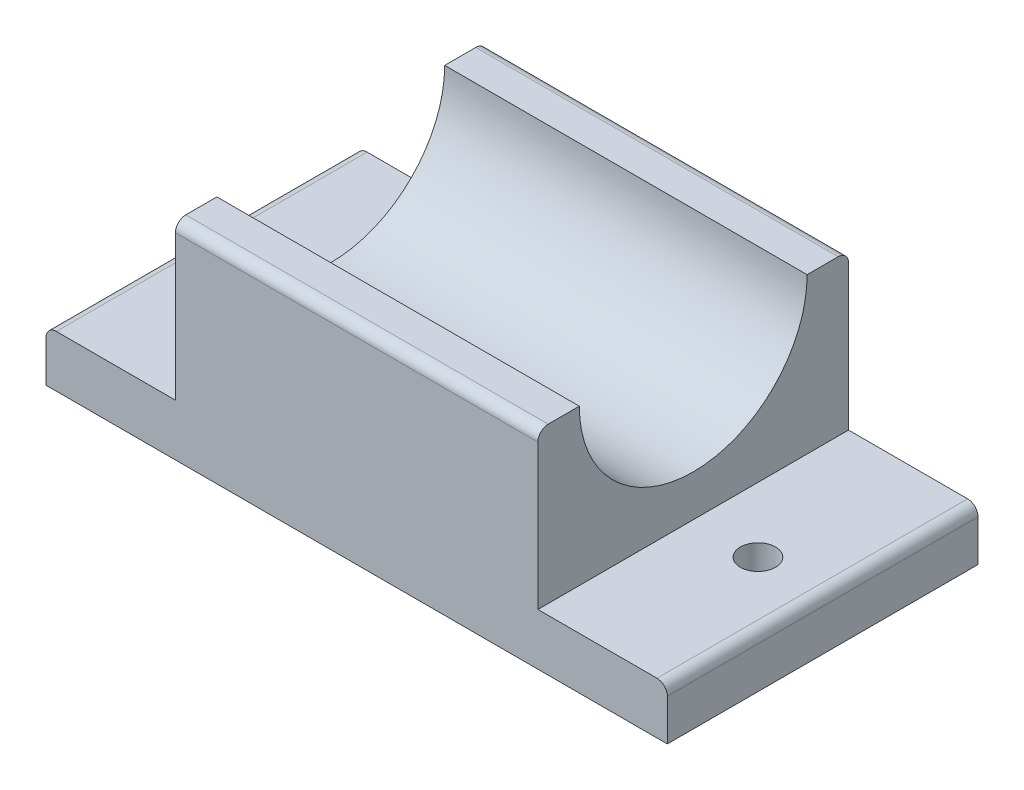
ISO-10303-21;
HEADER;
FILE_DESCRIPTION(('STEP AP214'),'2;1');
FILE_NAME('part.step','',(''),(''),'','','');
FILE_SCHEMA(('AUTOMOTIVE_DESIGN { 1 0 10303 214 1 1 1 1 }'));
ENDSEC;
DATA;
#1=APPLICATION_CONTEXT('core data for automotive mechanical design processes');
#2=APPLICATION_PROTOCOL_DEFINITION('international standard','automotive_design',2000,#1);
#3=PRODUCT_CONTEXT('',#1,'mechanical');
#4=PRODUCT('Part','Part','',(#3));
#5=PRODUCT_RELATED_PRODUCT_CATEGORY('part','',(#4));
#6=PRODUCT_DEFINITION_FORMATION('','',#4);
#7=PRODUCT_DEFINITION_CONTEXT('part definition',#1,'design');
#8=PRODUCT_DEFINITION('design','',#6,#7);
#9=PRODUCT_DEFINITION_SHAPE('','',#8);
#10=(LENGTH_UNIT() NAMED_UNIT(*) SI_UNIT(.MILLI.,.METRE.));
#11=(NAMED_UNIT(*) PLANE_ANGLE_UNIT() SI_UNIT($,.RADIAN.));
#12=(NAMED_UNIT(*) SI_UNIT($,.STERADIAN.) SOLID_ANGLE_UNIT());
#13=UNCERTAINTY_MEASURE_WITH_UNIT(LENGTH_MEASURE(1.E-05),#10,'distance_accuracy_value','');
#14=(GEOMETRIC_REPRESENTATION_CONTEXT(3) GLOBAL_UNCERTAINTY_ASSIGNED_CONTEXT((#13)) GLOBAL_UNIT_ASSIGNED_CONTEXT((#10,
#11,#12)) REPRESENTATION_CONTEXT('',''));
#15=CARTESIAN_POINT('',(0.,0.,0.));
#16=DIRECTION('',(0.,0.,1.));
#17=DIRECTION('',(1.,0.,0.));
#18=AXIS2_PLACEMENT_3D('',#15,#16,#17);
#19=CARTESIAN_POINT('',(0.,20.,0.));
#20=DIRECTION('',(0.,1.,0.));
#21=DIRECTION('',(0.,0.,1.));
#22=AXIS2_PLACEMENT_3D('',#19,#20,#21);
#23=PLANE('',#22);
#24=DIRECTION('',(0.,0.,1.));
#25=VECTOR('',#24,1.);
#26=CARTESIAN_POINT('',(-5.11363636363637,20.,-19.0422077922078));
#27=LINE('',#26,#25);
#28=CARTESIAN_POINT('',(-5.11363636363637,20.,6.9577922077922));
#29=VERTEX_POINT('',#28);
#30=CARTESIAN_POINT('',(-5.11363636363637,20.,9.95779220779221));
#31=VERTEX_POINT('',#30);
#32=EDGE_CURVE('E167',#29,#31,#27,.T.);
#33=ORIENTED_EDGE('',*,*,#32,.T.);
#34=DIRECTION('',(1.,0.,0.));
#35=VECTOR('',#34,1.);
#36=CARTESIAN_POINT('',(29.8863636363636,20.,9.95779220779221));
#37=LINE('',#36,#35);
#38=CARTESIAN_POINT('',(29.8863636363636,20.,9.95779220779221));
#39=VERTEX_POINT('',#38);
#40=EDGE_CURVE('E138',#31,#39,#37,.T.);
#41=ORIENTED_EDGE('',*,*,#40,.T.);
#42=DIRECTION('',(0.,0.,-1.));
#43=VECTOR('',#42,1.);
#44=CARTESIAN_POINT('',(29.8863636363636,20.,-19.0422077922078));
#45=LINE('',#44,#43);
#46=CARTESIAN_POINT('',(29.8863636363636,20.,6.9577922077922));
#47=VERTEX_POINT('',#46);
#48=EDGE_CURVE('E132',#39,#47,#45,.T.);
#49=ORIENTED_EDGE('',*,*,#48,.T.);
#50=DIRECTION('',(1.,0.,0.));
#51=VECTOR('',#50,1.);
#52=CARTESIAN_POINT('',(-17.6136363636364,20.,6.9577922077922));
#53=LINE('',#52,#51);
#54=EDGE_CURVE('E135',#29,#47,#53,.T.);
#55=ORIENTED_EDGE('',*,*,#54,.F.);
#56=EDGE_LOOP('',(#33,#41,#49,#55));
#57=FACE_BOUND('',#56,.T.);
#58=ADVANCED_FACE('F32',(#57),#23,.T.);
#59=CARTESIAN_POINT('',(0.,5.,0.));
#60=DIRECTION('',(0.,1.,0.));
#61=DIRECTION('',(0.,0.,1.));
#62=AXIS2_PLACEMENT_3D('',#59,#60,#61);
#63=PLANE('',#62);
#64=CARTESIAN_POINT('',(-11.3636363636364,5.,-4.04220779220779));
#65=DIRECTION('',(0.,1.,0.));
#66=DIRECTION('',(0.,0.,1.));
#67=AXIS2_PLACEMENT_3D('',#64,#65,#66);
#68=CIRCLE('',#67,1.7);
#69=CARTESIAN_POINT('',(-11.3636363636364,5.,-2.34220779220779));
#70=VERTEX_POINT('',#69);
#71=EDGE_CURVE('E162',#70,#70,#68,.T.);
#72=ORIENTED_EDGE('',*,*,#71,.F.);
#73=EDGE_LOOP('',(#72));
#74=FACE_BOUND('',#73,.T.);
#75=DIRECTION('',(-1.,0.,0.));
#76=VECTOR('',#75,1.);
#77=CARTESIAN_POINT('',(-17.6136363636364,5.,-19.0422077922078));
#78=LINE('',#77,#76);
#79=CARTESIAN_POINT('',(-5.11363636363637,5.,-19.0422077922078));
#80=VERTEX_POINT('',#79);
#81=CARTESIAN_POINT('',(-16.6136363636364,5.,-19.0422077922078));
#82=VERTEX_POINT('',#81);
#83=EDGE_CURVE('E186',#80,#82,#78,.T.);
#84=ORIENTED_EDGE('',*,*,#83,.T.);
#85=DIRECTION('',(0.,0.,1.));
#86=VECTOR('',#85,1.);
#87=CARTESIAN_POINT('',(-16.6136363636364,5.,10.9577922077922));
#88=LINE('',#87,#86);
#89=CARTESIAN_POINT('',(-16.6136363636364,5.,10.9577922077922));
#90=VERTEX_POINT('',#89);
#91=EDGE_CURVE('E235',#82,#90,#88,.T.);
#92=ORIENTED_EDGE('',*,*,#91,.T.);
#93=DIRECTION('',(1.,0.,0.));
#94=VECTOR('',#93,1.);
#95=CARTESIAN_POINT('',(-17.6136363636364,5.,10.9577922077922));
#96=LINE('',#95,#94);
#97=CARTESIAN_POINT('',(-5.11363636363637,5.,10.9577922077922));
#98=VERTEX_POINT('',#97);
#99=EDGE_CURVE('E184',#90,#98,#96,.T.);
#100=ORIENTED_EDGE('',*,*,#99,.T.);
#101=DIRECTION('',(0.,0.,1.));
#102=VECTOR('',#101,1.);
#103=CARTESIAN_POINT('',(-5.11363636363637,5.,-19.0422077922078));
#104=LINE('',#103,#102);
#105=EDGE_CURVE('E159',#80,#98,#104,.T.);
#106=ORIENTED_EDGE('',*,*,#105,.F.);
#107=EDGE_LOOP('',(#84,#92,#100,#106));
#108=FACE_BOUND('',#107,.T.);
#109=ADVANCED_FACE('F241',(#74,#108),#63,.T.);
#110=CARTESIAN_POINT('',(-17.6136363636364,5.,-19.0422077922078));
#111=DIRECTION('',(1.,0.,0.));
#112=DIRECTION('',(0.,0.,-1.));
#113=AXIS2_PLACEMENT_3D('',#110,#111,#112);
#114=PLANE('',#113);
#115=DIRECTION('',(0.,-1.,0.));
#116=VECTOR('',#115,1.);
#117=CARTESIAN_POINT('',(-17.6136363636364,5.,10.9577922077922));
#118=LINE('',#117,#116);
#119=CARTESIAN_POINT('',(-17.6136363636364,4.,10.9577922077922));
#120=VERTEX_POINT('',#119);
#121=CARTESIAN_POINT('',(-17.6136363636364,0.,10.9577922077922));
#122=VERTEX_POINT('',#121);
#123=EDGE_CURVE('E207',#120,#122,#118,.T.);
#124=ORIENTED_EDGE('',*,*,#123,.F.);
#125=DIRECTION('',(0.,0.,1.));
#126=VECTOR('',#125,1.);
#127=CARTESIAN_POINT('',(-17.6136363636364,4.,-19.0422077922078));
#128=LINE('',#127,#126);
#129=CARTESIAN_POINT('',(-17.6136363636364,4.,-19.0422077922078));
#130=VERTEX_POINT('',#129);
#131=EDGE_CURVE('E40',#120,#130,#128,.F.);
#132=ORIENTED_EDGE('',*,*,#131,.T.);
#133=DIRECTION('',(0.,-1.,0.));
#134=VECTOR('',#133,1.);
#135=CARTESIAN_POINT('',(-17.6136363636364,5.,-19.0422077922078));
#136=LINE('',#135,#134);
#137=CARTESIAN_POINT('',(-17.6136363636364,0.,-19.0422077922078));
#138=VERTEX_POINT('',#137);
#139=EDGE_CURVE('E190',#130,#138,#136,.T.);
#140=ORIENTED_EDGE('',*,*,#139,.T.);
#141=DIRECTION('',(0.,0.,1.));
#142=VECTOR('',#141,1.);
#143=CARTESIAN_POINT('',(-17.6136363636364,0.,-19.0422077922078));
#144=LINE('',#143,#142);
#145=EDGE_CURVE('E183',#138,#122,#144,.T.);
#146=ORIENTED_EDGE('',*,*,#145,.T.);
#147=EDGE_LOOP('',(#124,#132,#140,#146));
#148=FACE_BOUND('',#147,.T.);
#149=ADVANCED_FACE('F271',(#148),#114,.F.);
#150=CARTESIAN_POINT('',(-17.6136363636364,5.,10.9577922077922));
#151=DIRECTION('',(0.,0.,-1.));
#152=DIRECTION('',(-1.,0.,0.));
#153=AXIS2_PLACEMENT_3D('',#150,#151,#152);
#154=PLANE('',#153);
#155=ORIENTED_EDGE('',*,*,#99,.F.);
#156=CARTESIAN_POINT('',(-16.6136363636364,4.,10.9577922077922));
#157=DIRECTION('',(0.,0.,-1.));
#158=DIRECTION('',(-1.,0.,0.));
#159=AXIS2_PLACEMENT_3D('',#156,#157,#158);
#160=CIRCLE('',#159,1.);
#161=EDGE_CURVE('E54',#90,#120,#160,.F.);
#162=ORIENTED_EDGE('',*,*,#161,.T.);
#163=ORIENTED_EDGE('',*,*,#123,.T.);
#164=DIRECTION('',(1.,0.,0.));
#165=VECTOR('',#164,1.);
#166=CARTESIAN_POINT('',(-17.6136363636364,0.,10.9577922077922));
#167=LINE('',#166,#165);
#168=CARTESIAN_POINT('',(42.3863636363636,0.,10.9577922077922));
#169=VERTEX_POINT('',#168);
#170=EDGE_CURVE('E193',#122,#169,#167,.T.);
#171=ORIENTED_EDGE('',*,*,#170,.T.);
#172=DIRECTION('',(0.,-1.,0.));
#173=VECTOR('',#172,1.);
#174=CARTESIAN_POINT('',(42.3863636363636,5.,10.9577922077922));
#175=LINE('',#174,#173);
#176=CARTESIAN_POINT('',(42.3863636363636,4.,10.9577922077922));
#177=VERTEX_POINT('',#176);
#178=EDGE_CURVE('E205',#177,#169,#175,.T.);
#179=ORIENTED_EDGE('',*,*,#178,.F.);
#180=CARTESIAN_POINT('',(41.3863636363636,4.,10.9577922077922));
#181=DIRECTION('',(0.,0.,-1.));
#182=DIRECTION('',(-1.,0.,0.));
#183=AXIS2_PLACEMENT_3D('',#180,#181,#182);
#184=CIRCLE('',#183,1.);
#185=CARTESIAN_POINT('',(41.3863636363636,5.,10.9577922077922));
#186=VERTEX_POINT('',#185);
#187=EDGE_CURVE('E233',#177,#186,#184,.F.);
#188=ORIENTED_EDGE('',*,*,#187,.T.);
#189=CARTESIAN_POINT('',(29.8863636363636,5.,10.9577922077922));
#190=VERTEX_POINT('',#189);
#191=EDGE_CURVE('E187',#190,#186,#96,.T.);
#192=ORIENTED_EDGE('',*,*,#191,.F.);
#193=DIRECTION('',(0.,-1.,0.));
#194=VECTOR('',#193,1.);
#195=CARTESIAN_POINT('',(29.8863636363636,20.,10.9577922077922));
#196=LINE('',#195,#194);
#197=CARTESIAN_POINT('',(29.8863636363636,19.,10.9577922077922));
#198=VERTEX_POINT('',#197);
#199=EDGE_CURVE('E178',#198,#190,#196,.T.);
#200=ORIENTED_EDGE('',*,*,#199,.F.);
#201=DIRECTION('',(1.,0.,0.));
#202=VECTOR('',#201,1.);
#203=CARTESIAN_POINT('',(-5.11363636363637,19.,10.9577922077922));
#204=LINE('',#203,#202);
#205=CARTESIAN_POINT('',(-5.11363636363637,19.,10.9577922077922));
#206=VERTEX_POINT('',#205);
#207=EDGE_CURVE('E213',#198,#206,#204,.F.);
#208=ORIENTED_EDGE('',*,*,#207,.T.);
#209=DIRECTION('',(0.,-1.,0.));
#210=VECTOR('',#209,1.);
#211=CARTESIAN_POINT('',(-5.11363636363637,20.,10.9577922077922));
#212=LINE('',#211,#210);
#213=EDGE_CURVE('E180',#206,#98,#212,.T.);
#214=ORIENTED_EDGE('',*,*,#213,.T.);
#215=EDGE_LOOP('',(#155,#162,#163,#171,#179,#188,#192,#200,#208,#214));
#216=FACE_BOUND('',#215,.T.);
#217=ADVANCED_FACE('F246',(#216),#154,.F.);
#218=CARTESIAN_POINT('',(42.3863636363636,5.,-19.0422077922078));
#219=DIRECTION('',(-1.,0.,0.));
#220=DIRECTION('',(0.,0.,1.));
#221=AXIS2_PLACEMENT_3D('',#218,#219,#220);
#222=PLANE('',#221);
#223=DIRECTION('',(0.,-1.,0.));
#224=VECTOR('',#223,1.);
#225=CARTESIAN_POINT('',(42.3863636363636,5.,-19.0422077922078));
#226=LINE('',#225,#224);
#227=CARTESIAN_POINT('',(42.3863636363636,4.,-19.0422077922078));
#228=VERTEX_POINT('',#227);
#229=CARTESIAN_POINT('',(42.3863636363636,0.,-19.0422077922078));
#230=VERTEX_POINT('',#229);
#231=EDGE_CURVE('E203',#228,#230,#226,.T.);
#232=ORIENTED_EDGE('',*,*,#231,.F.);
#233=DIRECTION('',(0.,0.,-1.));
#234=VECTOR('',#233,1.);
#235=CARTESIAN_POINT('',(42.3863636363636,4.,10.9577922077922));
#236=LINE('',#235,#234);
#237=EDGE_CURVE('E231',#228,#177,#236,.F.);
#238=ORIENTED_EDGE('',*,*,#237,.T.);
#239=ORIENTED_EDGE('',*,*,#178,.T.);
#240=DIRECTION('',(0.,0.,-1.));
#241=VECTOR('',#240,1.);
#242=CARTESIAN_POINT('',(42.3863636363636,0.,-19.0422077922078));
#243=LINE('',#242,#241);
#244=EDGE_CURVE('E196',#169,#230,#243,.T.);
#245=ORIENTED_EDGE('',*,*,#244,.T.);
#246=EDGE_LOOP('',(#232,#238,#239,#245));
#247=FACE_BOUND('',#246,.T.);
#248=ADVANCED_FACE('F300',(#247),#222,.F.);
#249=CARTESIAN_POINT('',(-17.6136363636364,5.,-19.0422077922078));
#250=DIRECTION('',(0.,0.,1.));
#251=DIRECTION('',(1.,0.,0.));
#252=AXIS2_PLACEMENT_3D('',#249,#250,#251);
#253=PLANE('',#252);
#254=ORIENTED_EDGE('',*,*,#139,.F.);
#255=CARTESIAN_POINT('',(-16.6136363636364,4.,-19.0422077922078));
#256=DIRECTION('',(0.,0.,1.));
#257=DIRECTION('',(1.,0.,0.));
#258=AXIS2_PLACEMENT_3D('',#255,#256,#257);
#259=CIRCLE('',#258,1.);
#260=EDGE_CURVE('E11',#130,#82,#259,.F.);
#261=ORIENTED_EDGE('',*,*,#260,.T.);
#262=ORIENTED_EDGE('',*,*,#83,.F.);
#263=DIRECTION('',(0.,-1.,0.));
#264=VECTOR('',#263,1.);
#265=CARTESIAN_POINT('',(-5.11363636363637,20.,-19.0422077922078));
#266=LINE('',#265,#264);
#267=CARTESIAN_POINT('',(-5.11363636363637,19.,-19.0422077922078));
#268=VERTEX_POINT('',#267);
#269=EDGE_CURVE('E141',#268,#80,#266,.T.);
#270=ORIENTED_EDGE('',*,*,#269,.F.);
#271=DIRECTION('',(-1.,0.,0.));
#272=VECTOR('',#271,1.);
#273=CARTESIAN_POINT('',(29.8863636363636,19.,-19.0422077922078));
#274=LINE('',#273,#272);
#275=CARTESIAN_POINT('',(29.8863636363636,19.,-19.0422077922078));
#276=VERTEX_POINT('',#275);
#277=EDGE_CURVE('E222',#268,#276,#274,.F.);
#278=ORIENTED_EDGE('',*,*,#277,.T.);
#279=DIRECTION('',(0.,-1.,0.));
#280=VECTOR('',#279,1.);
#281=CARTESIAN_POINT('',(29.8863636363636,20.,-19.0422077922078));
#282=LINE('',#281,#280);
#283=CARTESIAN_POINT('',(29.8863636363636,5.,-19.0422077922078));
#284=VERTEX_POINT('',#283);
#285=EDGE_CURVE('E175',#276,#284,#282,.T.);
#286=ORIENTED_EDGE('',*,*,#285,.T.);
#287=CARTESIAN_POINT('',(41.3863636363636,5.,-19.0422077922078));
#288=VERTEX_POINT('',#287);
#289=EDGE_CURVE('E188',#288,#284,#78,.T.);
#290=ORIENTED_EDGE('',*,*,#289,.F.);
#291=CARTESIAN_POINT('',(41.3863636363636,4.,-19.0422077922078));
#292=DIRECTION('',(0.,0.,1.));
#293=DIRECTION('',(1.,0.,0.));
#294=AXIS2_PLACEMENT_3D('',#291,#292,#293);
#295=CIRCLE('',#294,1.);
#296=EDGE_CURVE('E229',#288,#228,#295,.F.);
#297=ORIENTED_EDGE('',*,*,#296,.T.);
#298=ORIENTED_EDGE('',*,*,#231,.T.);
#299=DIRECTION('',(-1.,0.,0.));
#300=VECTOR('',#299,1.);
#301=CARTESIAN_POINT('',(-17.6136363636364,0.,-19.0422077922078));
#302=LINE('',#301,#300);
#303=EDGE_CURVE('E199',#230,#138,#302,.T.);
#304=ORIENTED_EDGE('',*,*,#303,.T.);
#305=EDGE_LOOP('',(#254,#261,#262,#270,#278,#286,#290,#297,#298,#304));
#306=FACE_BOUND('',#305,.T.);
#307=ADVANCED_FACE('F256',(#306),#253,.F.);
#308=CARTESIAN_POINT('',(36.1363636363636,5.,-4.04220779220779));
#309=DIRECTION('',(0.,1.,0.));
#310=DIRECTION('',(0.,0.,1.));
#311=AXIS2_PLACEMENT_3D('',#308,#309,#310);
#312=CIRCLE('',#311,1.7);
#313=CARTESIAN_POINT('',(36.1363636363636,5.,-2.34220779220779));
#314=VERTEX_POINT('',#313);
#315=EDGE_CURVE('E433',#314,#314,#312,.T.);
#316=ORIENTED_EDGE('',*,*,#315,.F.);
#317=EDGE_LOOP('',(#316));
#318=FACE_BOUND('',#317,.T.);
#319=ORIENTED_EDGE('',*,*,#191,.T.);
#320=DIRECTION('',(0.,0.,-1.));
#321=VECTOR('',#320,1.);
#322=CARTESIAN_POINT('',(41.3863636363636,5.,-19.0422077922078));
#323=LINE('',#322,#321);
#324=EDGE_CURVE('E226',#186,#288,#323,.T.);
#325=ORIENTED_EDGE('',*,*,#324,.T.);
#326=ORIENTED_EDGE('',*,*,#289,.T.);
#327=DIRECTION('',(0.,0.,-1.));
#328=VECTOR('',#327,1.);
#329=CARTESIAN_POINT('',(29.8863636363636,5.,-19.0422077922078));
#330=LINE('',#329,#328);
#331=EDGE_CURVE('E171',#190,#284,#330,.T.);
#332=ORIENTED_EDGE('',*,*,#331,.F.);
#333=EDGE_LOOP('',(#319,#325,#326,#332));
#334=FACE_BOUND('',#333,.T.);
#335=ADVANCED_FACE('F274',(#318,#334),#63,.T.);
#336=CARTESIAN_POINT('',(0.,0.,0.));
#337=DIRECTION('',(0.,1.,0.));
#338=DIRECTION('',(0.,0.,1.));
#339=AXIS2_PLACEMENT_3D('',#336,#337,#338);
#340=PLANE('',#339);
#341=CARTESIAN_POINT('',(36.1363636363636,0.,-4.04220779220779));
#342=DIRECTION('',(0.,1.,0.));
#343=DIRECTION('',(0.,0.,1.));
#344=AXIS2_PLACEMENT_3D('',#341,#342,#343);
#345=CIRCLE('',#344,1.7);
#346=CARTESIAN_POINT('',(36.1363636363636,0.,-2.34220779220779));
#347=VERTEX_POINT('',#346);
#348=EDGE_CURVE('E430',#347,#347,#345,.T.);
#349=ORIENTED_EDGE('',*,*,#348,.T.);
#350=EDGE_LOOP('',(#349));
#351=FACE_BOUND('',#350,.T.);
#352=CARTESIAN_POINT('',(-11.3636363636364,0.,-4.04220779220779));
#353=DIRECTION('',(0.,1.,0.));
#354=DIRECTION('',(0.,0.,1.));
#355=AXIS2_PLACEMENT_3D('',#352,#353,#354);
#356=CIRCLE('',#355,1.7);
#357=CARTESIAN_POINT('',(-11.3636363636364,0.,-2.34220779220779));
#358=VERTEX_POINT('',#357);
#359=EDGE_CURVE('E157',#358,#358,#356,.T.);
#360=ORIENTED_EDGE('',*,*,#359,.T.);
#361=EDGE_LOOP('',(#360));
#362=FACE_BOUND('',#361,.T.);
#363=ORIENTED_EDGE('',*,*,#145,.F.);
#364=ORIENTED_EDGE('',*,*,#303,.F.);
#365=ORIENTED_EDGE('',*,*,#244,.F.);
#366=ORIENTED_EDGE('',*,*,#170,.F.);
#367=EDGE_LOOP('',(#363,#364,#365,#366));
#368=FACE_BOUND('',#367,.T.);
#369=ADVANCED_FACE('F306',(#351,#362,#368),#340,.F.);
#370=CARTESIAN_POINT('',(-5.11363636363637,20.,-19.0422077922078));
#371=DIRECTION('',(1.,0.,0.));
#372=DIRECTION('',(0.,0.,-1.));
#373=AXIS2_PLACEMENT_3D('',#370,#371,#372);
#374=PLANE('',#373);
#375=CARTESIAN_POINT('',(-5.11363636363637,20.,-18.0422077922078));
#376=VERTEX_POINT('',#375);
#377=CARTESIAN_POINT('',(-5.11363636363637,20.,-15.0422077922078));
#378=VERTEX_POINT('',#377);
#379=EDGE_CURVE('E166',#376,#378,#27,.T.);
#380=ORIENTED_EDGE('',*,*,#379,.F.);
#381=CARTESIAN_POINT('',(-5.11363636363637,19.,-18.0422077922078));
#382=DIRECTION('',(1.,0.,0.));
#383=DIRECTION('',(0.,0.,-1.));
#384=AXIS2_PLACEMENT_3D('',#381,#382,#383);
#385=CIRCLE('',#384,1.);
#386=EDGE_CURVE('E220',#376,#268,#385,.F.);
#387=ORIENTED_EDGE('',*,*,#386,.T.);
#388=ORIENTED_EDGE('',*,*,#269,.T.);
#389=ORIENTED_EDGE('',*,*,#105,.T.);
#390=ORIENTED_EDGE('',*,*,#213,.F.);
#391=CARTESIAN_POINT('',(-5.11363636363637,19.,9.95779220779221));
#392=DIRECTION('',(1.,0.,0.));
#393=DIRECTION('',(0.,0.,-1.));
#394=AXIS2_PLACEMENT_3D('',#391,#392,#393);
#395=CIRCLE('',#394,1.);
#396=EDGE_CURVE('E215',#206,#31,#395,.F.);
#397=ORIENTED_EDGE('',*,*,#396,.T.);
#398=ORIENTED_EDGE('',*,*,#32,.F.);
#399=CARTESIAN_POINT('',(-5.11363636363637,20.,-4.0422077922078));
#400=DIRECTION('',(1.,0.,0.));
#401=DIRECTION('',(0.,0.,-1.));
#402=AXIS2_PLACEMENT_3D('',#399,#400,#401);
#403=CIRCLE('',#402,11.);
#404=EDGE_CURVE('E150',#29,#378,#403,.T.);
#405=ORIENTED_EDGE('',*,*,#404,.T.);
#406=EDGE_LOOP('',(#380,#387,#388,#389,#390,#397,#398,#405));
#407=FACE_BOUND('',#406,.T.);
#408=ADVANCED_FACE('F253',(#407),#374,.F.);
#409=CARTESIAN_POINT('',(29.8863636363636,20.,-19.0422077922078));
#410=DIRECTION('',(-1.,0.,0.));
#411=DIRECTION('',(0.,0.,1.));
#412=AXIS2_PLACEMENT_3D('',#409,#410,#411);
#413=PLANE('',#412);
#414=ORIENTED_EDGE('',*,*,#285,.F.);
#415=CARTESIAN_POINT('',(29.8863636363636,19.,-18.0422077922078));
#416=DIRECTION('',(-1.,0.,0.));
#417=DIRECTION('',(0.,0.,1.));
#418=AXIS2_PLACEMENT_3D('',#415,#416,#417);
#419=CIRCLE('',#418,1.);
#420=CARTESIAN_POINT('',(29.8863636363636,20.,-18.0422077922078));
#421=VERTEX_POINT('',#420);
#422=EDGE_CURVE('E224',#276,#421,#419,.F.);
#423=ORIENTED_EDGE('',*,*,#422,.T.);
#424=CARTESIAN_POINT('',(29.8863636363636,20.,-15.0422077922078));
#425=VERTEX_POINT('',#424);
#426=EDGE_CURVE('E142',#425,#421,#45,.T.);
#427=ORIENTED_EDGE('',*,*,#426,.F.);
#428=CARTESIAN_POINT('',(29.8863636363636,20.,-4.0422077922078));
#429=DIRECTION('',(1.,0.,0.));
#430=DIRECTION('',(0.,0.,-1.));
#431=AXIS2_PLACEMENT_3D('',#428,#429,#430);
#432=CIRCLE('',#431,11.);
#433=EDGE_CURVE('E147',#47,#425,#432,.T.);
#434=ORIENTED_EDGE('',*,*,#433,.F.);
#435=ORIENTED_EDGE('',*,*,#48,.F.);
#436=CARTESIAN_POINT('',(29.8863636363636,19.,9.95779220779221));
#437=DIRECTION('',(-1.,0.,0.));
#438=DIRECTION('',(0.,0.,1.));
#439=AXIS2_PLACEMENT_3D('',#436,#437,#438);
#440=CIRCLE('',#439,1.);
#441=EDGE_CURVE('E211',#39,#198,#440,.F.);
#442=ORIENTED_EDGE('',*,*,#441,.T.);
#443=ORIENTED_EDGE('',*,*,#199,.T.);
#444=ORIENTED_EDGE('',*,*,#331,.T.);
#445=EDGE_LOOP('',(#414,#423,#427,#434,#435,#442,#443,#444));
#446=FACE_BOUND('',#445,.T.);
#447=ADVANCED_FACE('F155',(#446),#413,.F.);
#448=ORIENTED_EDGE('',*,*,#426,.T.);
#449=DIRECTION('',(-1.,0.,0.));
#450=VECTOR('',#449,1.);
#451=CARTESIAN_POINT('',(-5.11363636363637,20.,-18.0422077922078));
#452=LINE('',#451,#450);
#453=EDGE_CURVE('E217',#421,#376,#452,.T.);
#454=ORIENTED_EDGE('',*,*,#453,.T.);
#455=ORIENTED_EDGE('',*,*,#379,.T.);
#456=DIRECTION('',(1.,0.,0.));
#457=VECTOR('',#456,1.);
#458=CARTESIAN_POINT('',(-17.6136363636364,20.,-15.0422077922078));
#459=LINE('',#458,#457);
#460=EDGE_CURVE('E151',#425,#378,#459,.F.);
#461=ORIENTED_EDGE('',*,*,#460,.F.);
#462=EDGE_LOOP('',(#448,#454,#455,#461));
#463=FACE_BOUND('',#462,.T.);
#464=ADVANCED_FACE('F267',(#463),#23,.T.);
#465=CARTESIAN_POINT('',(-17.6136363636364,20.,-4.0422077922078));
#466=DIRECTION('',(1.,0.,0.));
#467=DIRECTION('',(0.,0.,-1.));
#468=AXIS2_PLACEMENT_3D('',#465,#466,#467);
#469=CYLINDRICAL_SURFACE('',#468,11.);
#470=ORIENTED_EDGE('',*,*,#54,.T.);
#471=ORIENTED_EDGE('',*,*,#433,.T.);
#472=ORIENTED_EDGE('',*,*,#460,.T.);
#473=ORIENTED_EDGE('',*,*,#404,.F.);
#474=EDGE_LOOP('',(#470,#471,#472,#473));
#475=FACE_BOUND('',#474,.T.);
#476=ADVANCED_FACE('F145',(#475),#469,.F.);
#477=CARTESIAN_POINT('',(-11.3636363636364,5.,-4.04220779220779));
#478=DIRECTION('',(0.,1.,0.));
#479=DIRECTION('',(0.,0.,1.));
#480=AXIS2_PLACEMENT_3D('',#477,#478,#479);
#481=CYLINDRICAL_SURFACE('',#480,1.7);
#482=ORIENTED_EDGE('',*,*,#359,.F.);
#483=EDGE_LOOP('',(#482));
#484=FACE_BOUND('',#483,.T.);
#485=ORIENTED_EDGE('',*,*,#71,.T.);
#486=EDGE_LOOP('',(#485));
#487=FACE_BOUND('',#486,.T.);
#488=ADVANCED_FACE('F283',(#484,#487),#481,.F.);
#489=CARTESIAN_POINT('',(36.1363636363636,5.,-4.04220779220779));
#490=DIRECTION('',(0.,1.,0.));
#491=DIRECTION('',(0.,0.,1.));
#492=AXIS2_PLACEMENT_3D('',#489,#490,#491);
#493=CYLINDRICAL_SURFACE('',#492,1.7);
#494=ORIENTED_EDGE('',*,*,#348,.F.);
#495=EDGE_LOOP('',(#494));
#496=FACE_BOUND('',#495,.T.);
#497=ORIENTED_EDGE('',*,*,#315,.T.);
#498=EDGE_LOOP('',(#497));
#499=FACE_BOUND('',#498,.T.);
#500=ADVANCED_FACE('F317',(#496,#499),#493,.F.);
#501=CARTESIAN_POINT('',(0.,19.,9.95779220779221));
#502=DIRECTION('',(-1.,0.,0.));
#503=DIRECTION('',(0.,0.,1.));
#504=AXIS2_PLACEMENT_3D('',#501,#502,#503);
#505=CYLINDRICAL_SURFACE('',#504,1.);
#506=ORIENTED_EDGE('',*,*,#396,.F.);
#507=ORIENTED_EDGE('',*,*,#207,.F.);
#508=ORIENTED_EDGE('',*,*,#441,.F.);
#509=ORIENTED_EDGE('',*,*,#40,.F.);
#510=EDGE_LOOP('',(#506,#507,#508,#509));
#511=FACE_BOUND('',#510,.T.);
#512=ADVANCED_FACE('F288',(#511),#505,.T.);
#513=CARTESIAN_POINT('',(0.,19.,-18.0422077922078));
#514=DIRECTION('',(1.,0.,0.));
#515=DIRECTION('',(0.,0.,-1.));
#516=AXIS2_PLACEMENT_3D('',#513,#514,#515);
#517=CYLINDRICAL_SURFACE('',#516,1.);
#518=ORIENTED_EDGE('',*,*,#422,.F.);
#519=ORIENTED_EDGE('',*,*,#277,.F.);
#520=ORIENTED_EDGE('',*,*,#386,.F.);
#521=ORIENTED_EDGE('',*,*,#453,.F.);
#522=EDGE_LOOP('',(#518,#519,#520,#521));
#523=FACE_BOUND('',#522,.T.);
#524=ADVANCED_FACE('F263',(#523),#517,.T.);
#525=CARTESIAN_POINT('',(41.3863636363636,4.,0.));
#526=DIRECTION('',(0.,0.,1.));
#527=DIRECTION('',(1.,0.,0.));
#528=AXIS2_PLACEMENT_3D('',#525,#526,#527);
#529=CYLINDRICAL_SURFACE('',#528,1.);
#530=ORIENTED_EDGE('',*,*,#187,.F.);
#531=ORIENTED_EDGE('',*,*,#237,.F.);
#532=ORIENTED_EDGE('',*,*,#296,.F.);
#533=ORIENTED_EDGE('',*,*,#324,.F.);
#534=EDGE_LOOP('',(#530,#531,#532,#533));
#535=FACE_BOUND('',#534,.T.);
#536=ADVANCED_FACE('F259',(#535),#529,.T.);
#537=CARTESIAN_POINT('',(-16.6136363636364,4.,0.));
#538=DIRECTION('',(0.,0.,-1.));
#539=DIRECTION('',(-1.,0.,0.));
#540=AXIS2_PLACEMENT_3D('',#537,#538,#539);
#541=CYLINDRICAL_SURFACE('',#540,1.);
#542=ORIENTED_EDGE('',*,*,#260,.F.);
#543=ORIENTED_EDGE('',*,*,#131,.F.);
#544=ORIENTED_EDGE('',*,*,#161,.F.);
#545=ORIENTED_EDGE('',*,*,#91,.F.);
#546=EDGE_LOOP('',(#542,#543,#544,#545));
#547=FACE_BOUND('',#546,.T.);
#548=ADVANCED_FACE('F34',(#547),#541,.T.);
#549=CLOSED_SHELL('',(#58,#109,#149,#217,#248,#307,#335,#369,#408,#447,#464,#476,#488,#500,#512,
#524,#536,#548));
#550=MANIFOLD_SOLID_BREP('B2',#549);
#551=ADVANCED_BREP_SHAPE_REPRESENTATION('',(#18,#550),#14);
#552=SHAPE_DEFINITION_REPRESENTATION(#9,#551);
ENDSEC;
END-ISO-10303-21;
